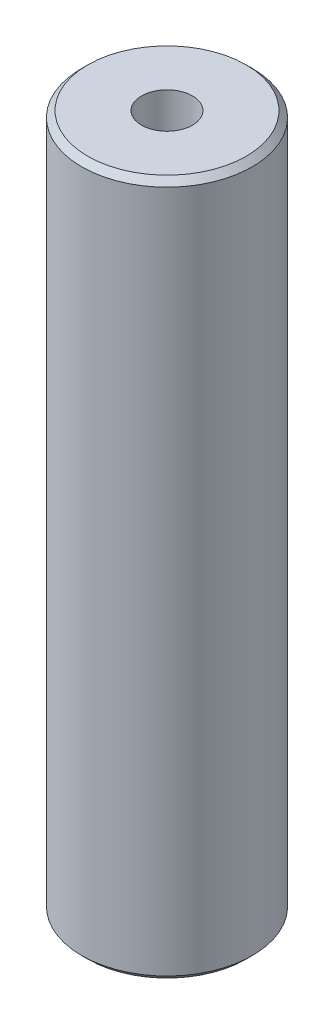
ISO-10303-21;
HEADER;
FILE_DESCRIPTION(('STEP AP214'),'2;1');
FILE_NAME('part.step','',(''),(''),'','','');
FILE_SCHEMA(('AUTOMOTIVE_DESIGN { 1 0 10303 214 1 1 1 1 }'));
ENDSEC;
DATA;
#1=APPLICATION_CONTEXT('core data for automotive mechanical design processes');
#2=APPLICATION_PROTOCOL_DEFINITION('international standard','automotive_design',2000,#1);
#3=PRODUCT_CONTEXT('',#1,'mechanical');
#4=PRODUCT('Part','Part','',(#3));
#5=PRODUCT_RELATED_PRODUCT_CATEGORY('part','',(#4));
#6=PRODUCT_DEFINITION_FORMATION('','',#4);
#7=PRODUCT_DEFINITION_CONTEXT('part definition',#1,'design');
#8=PRODUCT_DEFINITION('design','',#6,#7);
#9=PRODUCT_DEFINITION_SHAPE('','',#8);
#10=(LENGTH_UNIT() NAMED_UNIT(*) SI_UNIT(.MILLI.,.METRE.));
#11=(NAMED_UNIT(*) PLANE_ANGLE_UNIT() SI_UNIT($,.RADIAN.));
#12=(NAMED_UNIT(*) SI_UNIT($,.STERADIAN.) SOLID_ANGLE_UNIT());
#13=UNCERTAINTY_MEASURE_WITH_UNIT(LENGTH_MEASURE(1.E-05),#10,'distance_accuracy_value','');
#14=(GEOMETRIC_REPRESENTATION_CONTEXT(3) GLOBAL_UNCERTAINTY_ASSIGNED_CONTEXT((#13)) GLOBAL_UNIT_ASSIGNED_CONTEXT((#10,
#11,#12)) REPRESENTATION_CONTEXT('',''));
#15=CARTESIAN_POINT('',(0.,0.,0.));
#16=DIRECTION('',(0.,0.,1.));
#17=DIRECTION('',(1.,0.,0.));
#18=AXIS2_PLACEMENT_3D('',#15,#16,#17);
#19=CARTESIAN_POINT('',(0.,407.629747169299,0.));
#20=DIRECTION('',(0.,-1.,0.));
#21=DIRECTION('',(0.,0.,-1.));
#22=AXIS2_PLACEMENT_3D('',#19,#20,#21);
#23=CYLINDRICAL_SURFACE('',#22,50.);
#24=CARTESIAN_POINT('',(0.,404.056151087124,0.));
#25=DIRECTION('',(0.,1.,0.));
#26=DIRECTION('',(0.,0.,1.));
#27=AXIS2_PLACEMENT_3D('',#24,#25,#26);
#28=CIRCLE('',#27,50.);
#29=CARTESIAN_POINT('',(0.,404.056151087124,-50.));
#30=VERTEX_POINT('',#29);
#31=EDGE_CURVE('E50',#30,#30,#28,.F.);
#32=CARTESIAN_POINT('',(0.,3.57359608217628,0.));
#33=DIRECTION('',(0.,1.,0.));
#34=DIRECTION('',(0.,0.,1.));
#35=AXIS2_PLACEMENT_3D('',#32,#33,#34);
#36=CIRCLE('',#35,50.);
#37=CARTESIAN_POINT('',(0.,3.57359608217622,-50.));
#38=VERTEX_POINT('',#37);
#39=EDGE_CURVE('E51',#38,#38,#36,.T.);
#40=CARTESIAN_POINT('',(0.,404.056151087124,-50.));
#41=CARTESIAN_POINT('',(0.,399.884457805822,-50.));
#42=CARTESIAN_POINT('',(0.,395.71276452452,-50.));
#43=CARTESIAN_POINT('',(0.,387.369377961917,-50.));
#44=CARTESIAN_POINT('',(0.,383.197684680616,-50.));
#45=CARTESIAN_POINT('',(0.,374.854298118013,-50.));
#46=CARTESIAN_POINT('',(0.,370.682604836711,-50.));
#47=CARTESIAN_POINT('',(0.,362.339218274108,-50.));
#48=CARTESIAN_POINT('',(0.,358.167524992807,-50.));
#49=CARTESIAN_POINT('',(0.,349.824138430204,-50.));
#50=CARTESIAN_POINT('',(0.,345.652445148902,-50.));
#51=CARTESIAN_POINT('',(0.,337.309058586299,-50.));
#52=CARTESIAN_POINT('',(0.,333.137365304997,-50.));
#53=CARTESIAN_POINT('',(0.,324.793978742394,-50.));
#54=CARTESIAN_POINT('',(0.,320.622285461093,-50.));
#55=CARTESIAN_POINT('',(0.,312.27889889849,-50.));
#56=CARTESIAN_POINT('',(0.,308.107205617188,-50.));
#57=CARTESIAN_POINT('',(0.,299.763819054585,-50.));
#58=CARTESIAN_POINT('',(0.,295.592125773284,-50.));
#59=CARTESIAN_POINT('',(0.,287.248739210681,-50.));
#60=CARTESIAN_POINT('',(0.,283.077045929379,-50.));
#61=CARTESIAN_POINT('',(0.,274.733659366776,-50.));
#62=CARTESIAN_POINT('',(0.,270.561966085474,-50.));
#63=CARTESIAN_POINT('',(0.,262.218579522871,-50.));
#64=CARTESIAN_POINT('',(0.,258.04688624157,-50.));
#65=CARTESIAN_POINT('',(0.,249.703499678967,-50.));
#66=CARTESIAN_POINT('',(0.,245.531806397665,-50.));
#67=CARTESIAN_POINT('',(0.,237.188419835062,-50.));
#68=CARTESIAN_POINT('',(0.,233.016726553761,-50.));
#69=CARTESIAN_POINT('',(0.,224.673339991158,-50.));
#70=CARTESIAN_POINT('',(0.,220.501646709856,-50.));
#71=CARTESIAN_POINT('',(0.,212.158260147253,-50.));
#72=CARTESIAN_POINT('',(0.,207.986566865951,-50.));
#73=CARTESIAN_POINT('',(0.,199.643180303348,-50.));
#74=CARTESIAN_POINT('',(0.,195.471487022047,-50.));
#75=CARTESIAN_POINT('',(0.,187.128100459444,-50.));
#76=CARTESIAN_POINT('',(0.,182.956407178142,-50.));
#77=CARTESIAN_POINT('',(0.,174.613020615539,-50.));
#78=CARTESIAN_POINT('',(0.,170.441327334238,-50.));
#79=CARTESIAN_POINT('',(0.,162.097940771635,-50.));
#80=CARTESIAN_POINT('',(0.,157.926247490333,-50.));
#81=CARTESIAN_POINT('',(0.,149.58286092773,-50.));
#82=CARTESIAN_POINT('',(0.,145.411167646428,-50.));
#83=CARTESIAN_POINT('',(0.,137.067781083825,-50.));
#84=CARTESIAN_POINT('',(0.,132.896087802524,-50.));
#85=CARTESIAN_POINT('',(0.,124.552701239921,-50.));
#86=CARTESIAN_POINT('',(0.,120.381007958619,-50.));
#87=CARTESIAN_POINT('',(0.,112.037621396016,-50.));
#88=CARTESIAN_POINT('',(0.,107.865928114715,-50.));
#89=CARTESIAN_POINT('',(0.,99.5225415521115,-50.));
#90=CARTESIAN_POINT('',(0.,95.35084827081,-50.));
#91=CARTESIAN_POINT('',(0.,87.0074617082069,-50.));
#92=CARTESIAN_POINT('',(0.,82.8357684269054,-50.));
#93=CARTESIAN_POINT('',(0.,74.4923818643023,-50.));
#94=CARTESIAN_POINT('',(0.,70.3206885830008,-50.));
#95=CARTESIAN_POINT('',(0.,61.9773020203977,-50.));
#96=CARTESIAN_POINT('',(0.,57.8056087390962,-50.));
#97=CARTESIAN_POINT('',(0.,49.4622221764931,-50.));
#98=CARTESIAN_POINT('',(0.,45.2905288951915,-50.));
#99=CARTESIAN_POINT('',(0.,36.9471423325885,-50.));
#100=CARTESIAN_POINT('',(0.,32.775449051287,-50.));
#101=CARTESIAN_POINT('',(0.,24.4320624886839,-50.));
#102=CARTESIAN_POINT('',(0.,20.2603692073824,-50.));
#103=CARTESIAN_POINT('',(0.,11.9169826447793,-50.));
#104=CARTESIAN_POINT('',(0.,7.74528936347776,-50.));
#105=CARTESIAN_POINT('',(0.,3.57359608217622,-50.));
#106=B_SPLINE_CURVE_WITH_KNOTS('',3,(#40,#41,#42,#43,#44,#45,#46,#47,#48,#49,#50,#51,#52,#53,
#54,#55,#56,#57,#58,#59,#60,#61,#62,#63,#64,#65,#66,#67,#68,#69,#70,#71,#72,#73,#74,#75,#76,#77,
#78,#79,#80,#81,#82,#83,#84,#85,#86,#87,#88,#89,#90,#91,#92,#93,#94,#95,#96,#97,#98,#99,#100,
#101,#102,#103,#104,#105),.UNSPECIFIED.,.F.,.F.,(4,2,2,2,2,2,2,2,2,2,2,2,2,2,2,2,2,2,2,2,2,2,2,
2,2,2,2,2,2,2,2,2,4),(0.,12.5150798439046,25.0301596878092,37.5452395317138,50.0603193756184,
62.575399219523,75.0904790634276,87.6055589073322,100.120638751237,112.635718595141,
125.150798439046,137.665878282951,150.180958126855,162.69603797076,175.211117814664,
187.726197658569,200.241277502474,212.756357346378,225.271437190283,237.786517034187,
250.301596878092,262.816676721997,275.331756565901,287.846836409806,300.36191625371,
312.876996097615,325.39207594152,337.907155785424,350.422235629329,362.937315473233,
375.452395317138,387.967475161043,400.482555004947),.UNSPECIFIED.);
#107=EDGE_CURVE('BSEAM39',#30,#38,#106,.T.);
#108=ORIENTED_EDGE('',*,*,#31,.T.);
#109=ORIENTED_EDGE('',*,*,#39,.T.);
#110=ORIENTED_EDGE('',*,*,#107,.T.);
#111=ORIENTED_EDGE('',*,*,#107,.F.);
#112=EDGE_LOOP('',(#108,#110,#109,#111));
#113=FACE_BOUND('',#112,.T.);
#114=ADVANCED_FACE('F39',(#113),#23,.T.);
#115=CARTESIAN_POINT('',(0.,407.629747169299,0.));
#116=DIRECTION('',(0.,1.,0.));
#117=DIRECTION('',(0.,0.,1.));
#118=AXIS2_PLACEMENT_3D('',#115,#116,#117);
#119=PLANE('',#118);
#120=CARTESIAN_POINT('',(0.,407.629747169299,0.));
#121=DIRECTION('',(0.,1.,0.));
#122=DIRECTION('',(0.,0.,1.));
#123=AXIS2_PLACEMENT_3D('',#120,#121,#122);
#124=CIRCLE('',#123,46.4264039178243);
#125=CARTESIAN_POINT('',(0.,407.629747169299,46.4264039178243));
#126=VERTEX_POINT('',#125);
#127=EDGE_CURVE('E54',#126,#126,#124,.T.);
#128=ORIENTED_EDGE('',*,*,#127,.T.);
#129=EDGE_LOOP('',(#128));
#130=FACE_BOUND('',#129,.T.);
#131=CARTESIAN_POINT('',(0.,407.629747169299,0.));
#132=DIRECTION('',(0.,1.,0.));
#133=DIRECTION('',(0.,0.,1.));
#134=AXIS2_PLACEMENT_3D('',#131,#132,#133);
#135=CIRCLE('',#134,14.9052983190422);
#136=CARTESIAN_POINT('',(0.,407.629747169299,-14.9052983190422));
#137=VERTEX_POINT('',#136);
#138=EDGE_CURVE('E58',#137,#137,#135,.T.);
#139=ORIENTED_EDGE('',*,*,#138,.F.);
#140=EDGE_LOOP('',(#139));
#141=FACE_BOUND('',#140,.T.);
#142=ADVANCED_FACE('F69',(#130,#141),#119,.T.);
#143=CARTESIAN_POINT('',(0.,0.,0.));
#144=DIRECTION('',(0.,1.,0.));
#145=DIRECTION('',(0.,0.,1.));
#146=AXIS2_PLACEMENT_3D('',#143,#144,#145);
#147=PLANE('',#146);
#148=CARTESIAN_POINT('',(0.,0.,0.));
#149=DIRECTION('',(0.,1.,0.));
#150=DIRECTION('',(0.,0.,1.));
#151=AXIS2_PLACEMENT_3D('',#148,#149,#150);
#152=CIRCLE('',#151,46.4264039178237);
#153=CARTESIAN_POINT('',(0.,0.,46.4264039178237));
#154=VERTEX_POINT('',#153);
#155=EDGE_CURVE('E10',#154,#154,#152,.F.);
#156=ORIENTED_EDGE('',*,*,#155,.T.);
#157=EDGE_LOOP('',(#156));
#158=FACE_BOUND('',#157,.T.);
#159=CARTESIAN_POINT('',(0.,0.,0.));
#160=DIRECTION('',(0.,1.,0.));
#161=DIRECTION('',(0.,0.,1.));
#162=AXIS2_PLACEMENT_3D('',#159,#160,#161);
#163=CIRCLE('',#162,14.9052983190422);
#164=CARTESIAN_POINT('',(0.,0.,-14.9052983190422));
#165=VERTEX_POINT('',#164);
#166=EDGE_CURVE('E63',#165,#165,#163,.T.);
#167=ORIENTED_EDGE('',*,*,#166,.T.);
#168=EDGE_LOOP('',(#167));
#169=FACE_BOUND('',#168,.T.);
#170=ADVANCED_FACE('F75',(#158,#169),#147,.F.);
#171=CARTESIAN_POINT('',(0.,407.629747169299,0.));
#172=DIRECTION('',(0.,-1.,0.));
#173=DIRECTION('',(0.,0.,-1.));
#174=AXIS2_PLACEMENT_3D('',#171,#172,#173);
#175=CYLINDRICAL_SURFACE('',#174,14.9052983190422);
#176=CARTESIAN_POINT('',(0.,407.629747169299,-14.9052983190422));
#177=CARTESIAN_POINT('',(0.,403.383603969619,-14.9052983190422));
#178=CARTESIAN_POINT('',(0.,399.137460769939,-14.9052983190422));
#179=CARTESIAN_POINT('',(0.,390.645174370578,-14.9052983190422));
#180=CARTESIAN_POINT('',(0.,386.399031170898,-14.9052983190422));
#181=CARTESIAN_POINT('',(0.,377.906744771538,-14.9052983190422));
#182=CARTESIAN_POINT('',(0.,373.660601571858,-14.9052983190422));
#183=CARTESIAN_POINT('',(0.,365.168315172497,-14.9052983190422));
#184=CARTESIAN_POINT('',(0.,360.922171972817,-14.9052983190422));
#185=CARTESIAN_POINT('',(0.,352.429885573457,-14.9052983190422));
#186=CARTESIAN_POINT('',(0.,348.183742373776,-14.9052983190422));
#187=CARTESIAN_POINT('',(0.,339.691455974416,-14.9052983190422));
#188=CARTESIAN_POINT('',(0.,335.445312774736,-14.9052983190422));
#189=CARTESIAN_POINT('',(0.,326.953026375375,-14.9052983190422));
#190=CARTESIAN_POINT('',(0.,322.706883175695,-14.9052983190422));
#191=CARTESIAN_POINT('',(0.,314.214596776335,-14.9052983190422));
#192=CARTESIAN_POINT('',(0.,309.968453576655,-14.9052983190422));
#193=CARTESIAN_POINT('',(0.,301.476167177294,-14.9052983190422));
#194=CARTESIAN_POINT('',(0.,297.230023977614,-14.9052983190422));
#195=CARTESIAN_POINT('',(0.,288.737737578254,-14.9052983190422));
#196=CARTESIAN_POINT('',(0.,284.491594378573,-14.9052983190422));
#197=CARTESIAN_POINT('',(0.,275.999307979213,-14.9052983190422));
#198=CARTESIAN_POINT('',(0.,271.753164779533,-14.9052983190422));
#199=CARTESIAN_POINT('',(0.,263.260878380172,-14.9052983190422));
#200=CARTESIAN_POINT('',(0.,259.014735180492,-14.9052983190422));
#201=CARTESIAN_POINT('',(0.,250.522448781132,-14.9052983190422));
#202=CARTESIAN_POINT('',(0.,246.276305581452,-14.9052983190422));
#203=CARTESIAN_POINT('',(0.,237.784019182091,-14.9052983190422));
#204=CARTESIAN_POINT('',(0.,233.537875982411,-14.9052983190422));
#205=CARTESIAN_POINT('',(0.,225.045589583051,-14.9052983190422));
#206=CARTESIAN_POINT('',(0.,220.79944638337,-14.9052983190422));
#207=CARTESIAN_POINT('',(0.,212.30715998401,-14.9052983190422));
#208=CARTESIAN_POINT('',(0.,208.06101678433,-14.9052983190422));
#209=CARTESIAN_POINT('',(0.,199.568730384969,-14.9052983190422));
#210=CARTESIAN_POINT('',(0.,195.322587185289,-14.9052983190422));
#211=CARTESIAN_POINT('',(0.,186.830300785929,-14.9052983190422));
#212=CARTESIAN_POINT('',(0.,182.584157586249,-14.9052983190422));
#213=CARTESIAN_POINT('',(0.,174.091871186888,-14.9052983190422));
#214=CARTESIAN_POINT('',(0.,169.845727987208,-14.9052983190422));
#215=CARTESIAN_POINT('',(0.,161.353441587848,-14.9052983190422));
#216=CARTESIAN_POINT('',(0.,157.107298388167,-14.9052983190422));
#217=CARTESIAN_POINT('',(0.,148.615011988807,-14.9052983190422));
#218=CARTESIAN_POINT('',(0.,144.368868789127,-14.9052983190422));
#219=CARTESIAN_POINT('',(0.,135.876582389766,-14.9052983190422));
#220=CARTESIAN_POINT('',(0.,131.630439190086,-14.9052983190422));
#221=CARTESIAN_POINT('',(0.,123.138152790726,-14.9052983190422));
#222=CARTESIAN_POINT('',(0.,118.892009591046,-14.9052983190422));
#223=CARTESIAN_POINT('',(0.,110.399723191685,-14.9052983190422));
#224=CARTESIAN_POINT('',(0.,106.153579992005,-14.9052983190422));
#225=CARTESIAN_POINT('',(0.,97.6612935926446,-14.9052983190422));
#226=CARTESIAN_POINT('',(0.,93.4151503929644,-14.9052983190422));
#227=CARTESIAN_POINT('',(0.,84.9228639936041,-14.9052983190422));
#228=CARTESIAN_POINT('',(0.,80.6767207939238,-14.9052983190422));
#229=CARTESIAN_POINT('',(0.,72.1844343945634,-14.9052983190422));
#230=CARTESIAN_POINT('',(0.,67.9382911948832,-14.9052983190422));
#231=CARTESIAN_POINT('',(0.,59.4460047955228,-14.9052983190422));
#232=CARTESIAN_POINT('',(0.,55.1998615958426,-14.9052983190422));
#233=CARTESIAN_POINT('',(0.,46.7075751964822,-14.9052983190422));
#234=CARTESIAN_POINT('',(0.,42.461431996802,-14.9052983190422));
#235=CARTESIAN_POINT('',(0.,33.9691455974416,-14.9052983190422));
#236=CARTESIAN_POINT('',(0.,29.7230023977614,-14.9052983190422));
#237=CARTESIAN_POINT('',(0.,21.230715998401,-14.9052983190422));
#238=CARTESIAN_POINT('',(0.,16.9845727987208,-14.9052983190422));
#239=CARTESIAN_POINT('',(0.,8.4922863993604,-14.9052983190422));
#240=CARTESIAN_POINT('',(0.,4.2461431996802,-14.9052983190422));
#241=CARTESIAN_POINT('',(0.,0.,-14.9052983190422));
#242=B_SPLINE_CURVE_WITH_KNOTS('',3,(#176,#177,#178,#179,#180,#181,#182,#183,#184,#185,#186,
#187,#188,#189,#190,#191,#192,#193,#194,#195,#196,#197,#198,#199,#200,#201,#202,#203,#204,#205,
#206,#207,#208,#209,#210,#211,#212,#213,#214,#215,#216,#217,#218,#219,#220,#221,#222,#223,#224,
#225,#226,#227,#228,#229,#230,#231,#232,#233,#234,#235,#236,#237,#238,#239,#240,#241),
.UNSPECIFIED.,.F.,.F.,(4,2,2,2,2,2,2,2,2,2,2,2,2,2,2,2,2,2,2,2,2,2,2,2,2,2,2,2,2,2,2,2,4),(0.,
12.7384295990406,25.4768591980812,38.2152887971218,50.9537183961624,63.692147995203,
76.4305775942437,89.1690071932842,101.907436792325,114.645866391365,127.384295990406,
140.122725589447,152.861155188487,165.599584787528,178.338014386568,191.076443985609,
203.81487358465,216.55330318369,229.291732782731,242.030162381772,254.768591980812,
267.507021579853,280.245451178893,292.983880777934,305.722310376974,318.460739976015,
331.199169575056,343.937599174096,356.676028773137,369.414458372177,382.152887971218,
394.891317570259,407.629747169299),.UNSPECIFIED.);
#243=EDGE_CURVE('BSEAM70',#137,#165,#242,.T.);
#244=ORIENTED_EDGE('',*,*,#138,.T.);
#245=ORIENTED_EDGE('',*,*,#166,.F.);
#246=ORIENTED_EDGE('',*,*,#243,.T.);
#247=ORIENTED_EDGE('',*,*,#243,.F.);
#248=EDGE_LOOP('',(#244,#246,#245,#247));
#249=FACE_BOUND('',#248,.T.);
#250=ADVANCED_FACE('F70',(#249),#175,.F.);
#251=CARTESIAN_POINT('',(0.,407.629747169299,0.));
#252=DIRECTION('',(0.,-1.,0.));
#253=DIRECTION('',(0.,0.,-1.));
#254=AXIS2_PLACEMENT_3D('',#251,#252,#253);
#255=CONICAL_SURFACE('',#254,46.4264039178243,0.785398163397443);
#256=ORIENTED_EDGE('',*,*,#31,.F.);
#257=EDGE_LOOP('',(#256));
#258=FACE_BOUND('',#257,.T.);
#259=ORIENTED_EDGE('',*,*,#127,.F.);
#260=EDGE_LOOP('',(#259));
#261=FACE_BOUND('',#260,.T.);
#262=ADVANCED_FACE('F81',(#258,#261),#255,.T.);
#263=CARTESIAN_POINT('',(0.,3.57359608217628,0.));
#264=DIRECTION('',(0.,1.,0.));
#265=DIRECTION('',(0.,0.,1.));
#266=AXIS2_PLACEMENT_3D('',#263,#264,#265);
#267=CONICAL_SURFACE('',#266,50.,0.785398163397451);
#268=ORIENTED_EDGE('',*,*,#155,.F.);
#269=EDGE_LOOP('',(#268));
#270=FACE_BOUND('',#269,.T.);
#271=ORIENTED_EDGE('',*,*,#39,.F.);
#272=EDGE_LOOP('',(#271));
#273=FACE_BOUND('',#272,.T.);
#274=ADVANCED_FACE('F45',(#270,#273),#267,.T.);
#275=CLOSED_SHELL('',(#114,#142,#170,#250,#262,#274));
#276=MANIFOLD_SOLID_BREP('B2',#275);
#277=ADVANCED_BREP_SHAPE_REPRESENTATION('',(#18,#276),#14);
#278=SHAPE_DEFINITION_REPRESENTATION(#9,#277);
ENDSEC;
END-ISO-10303-21;
